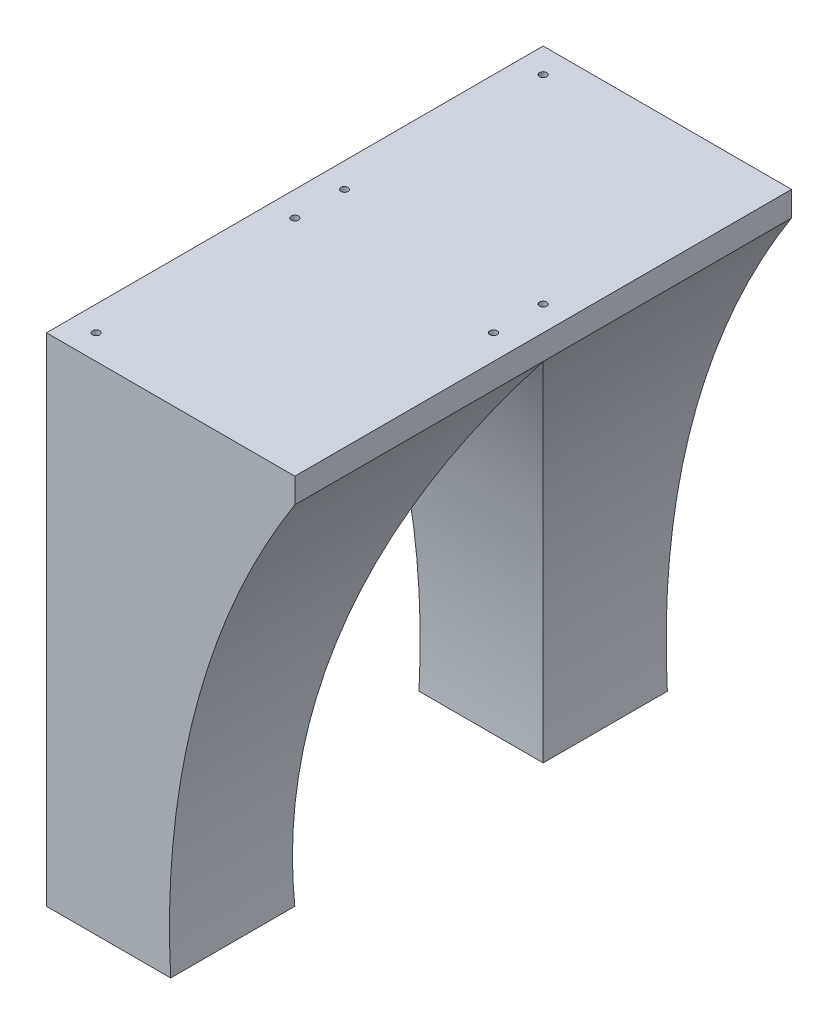
ISO-10303-21;
HEADER;
FILE_DESCRIPTION(('STEP AP214'),'2;1');
FILE_NAME('part.step','',(''),(''),'','','');
FILE_SCHEMA(('AUTOMOTIVE_DESIGN { 1 0 10303 214 1 1 1 1 }'));
ENDSEC;
DATA;
#1=APPLICATION_CONTEXT('core data for automotive mechanical design processes');
#2=APPLICATION_PROTOCOL_DEFINITION('international standard','automotive_design',2000,#1);
#3=PRODUCT_CONTEXT('',#1,'mechanical');
#4=PRODUCT('Part','Part','',(#3));
#5=PRODUCT_RELATED_PRODUCT_CATEGORY('part','',(#4));
#6=PRODUCT_DEFINITION_FORMATION('','',#4);
#7=PRODUCT_DEFINITION_CONTEXT('part definition',#1,'design');
#8=PRODUCT_DEFINITION('design','',#6,#7);
#9=PRODUCT_DEFINITION_SHAPE('','',#8);
#10=(LENGTH_UNIT() NAMED_UNIT(*) SI_UNIT(.MILLI.,.METRE.));
#11=(NAMED_UNIT(*) PLANE_ANGLE_UNIT() SI_UNIT($,.RADIAN.));
#12=(NAMED_UNIT(*) SI_UNIT($,.STERADIAN.) SOLID_ANGLE_UNIT());
#13=UNCERTAINTY_MEASURE_WITH_UNIT(LENGTH_MEASURE(1.E-05),#10,'distance_accuracy_value','');
#14=(GEOMETRIC_REPRESENTATION_CONTEXT(3) GLOBAL_UNCERTAINTY_ASSIGNED_CONTEXT((#13)) GLOBAL_UNIT_ASSIGNED_CONTEXT((#10,
#11,#12)) REPRESENTATION_CONTEXT('',''));
#15=CARTESIAN_POINT('',(0.,0.,0.));
#16=DIRECTION('',(0.,0.,1.));
#17=DIRECTION('',(1.,0.,0.));
#18=AXIS2_PLACEMENT_3D('',#15,#16,#17);
#19=CARTESIAN_POINT('',(0.,-200.,0.));
#20=DIRECTION('',(0.,-1.,0.));
#21=DIRECTION('',(0.,0.,-1.));
#22=AXIS2_PLACEMENT_3D('',#19,#20,#21);
#23=PLANE('',#22);
#24=DIRECTION('',(0.,0.,1.));
#25=VECTOR('',#24,1.);
#26=CARTESIAN_POINT('',(0.,-200.,0.));
#27=LINE('',#26,#25);
#28=CARTESIAN_POINT('',(0.,-200.,-50.));
#29=VERTEX_POINT('',#28);
#30=CARTESIAN_POINT('',(0.,-200.,0.));
#31=VERTEX_POINT('',#30);
#32=EDGE_CURVE('E65',#29,#31,#27,.T.);
#33=ORIENTED_EDGE('',*,*,#32,.F.);
#34=DIRECTION('',(-1.,0.,0.));
#35=VECTOR('',#34,1.);
#36=CARTESIAN_POINT('',(200.,-200.,-50.));
#37=LINE('',#36,#35);
#38=CARTESIAN_POINT('',(50.,-200.,-50.));
#39=VERTEX_POINT('',#38);
#40=EDGE_CURVE('E135',#39,#29,#37,.T.);
#41=ORIENTED_EDGE('',*,*,#40,.F.);
#42=DIRECTION('',(0.,0.,1.));
#43=VECTOR('',#42,1.);
#44=CARTESIAN_POINT('',(50.,-200.,-200.));
#45=LINE('',#44,#43);
#46=CARTESIAN_POINT('',(50.,-200.,0.));
#47=VERTEX_POINT('',#46);
#48=EDGE_CURVE('E50',#39,#47,#45,.T.);
#49=ORIENTED_EDGE('',*,*,#48,.T.);
#50=DIRECTION('',(1.,0.,0.));
#51=VECTOR('',#50,1.);
#52=CARTESIAN_POINT('',(0.,-200.,0.));
#53=LINE('',#52,#51);
#54=EDGE_CURVE('E155',#31,#47,#53,.T.);
#55=ORIENTED_EDGE('',*,*,#54,.F.);
#56=EDGE_LOOP('',(#33,#41,#49,#55));
#57=FACE_BOUND('',#56,.T.);
#58=ADVANCED_FACE('F41',(#57),#23,.T.);
#59=CARTESIAN_POINT('',(0.,-200.,0.));
#60=DIRECTION('',(-1.,0.,0.));
#61=DIRECTION('',(0.,0.,1.));
#62=AXIS2_PLACEMENT_3D('',#59,#60,#61);
#63=PLANE('',#62);
#64=DIRECTION('',(0.,0.,1.));
#65=VECTOR('',#64,1.);
#66=CARTESIAN_POINT('',(0.,0.,0.));
#67=LINE('',#66,#65);
#68=CARTESIAN_POINT('',(0.,0.,-200.));
#69=VERTEX_POINT('',#68);
#70=CARTESIAN_POINT('',(0.,0.,0.));
#71=VERTEX_POINT('',#70);
#72=EDGE_CURVE('E152',#69,#71,#67,.T.);
#73=ORIENTED_EDGE('',*,*,#72,.F.);
#74=DIRECTION('',(0.,1.,0.));
#75=VECTOR('',#74,1.);
#76=CARTESIAN_POINT('',(0.,-200.,-200.));
#77=LINE('',#76,#75);
#78=CARTESIAN_POINT('',(0.,-200.,-200.));
#79=VERTEX_POINT('',#78);
#80=EDGE_CURVE('E190',#79,#69,#77,.T.);
#81=ORIENTED_EDGE('',*,*,#80,.F.);
#82=DIRECTION('',(0.,0.,-1.));
#83=VECTOR('',#82,1.);
#84=CARTESIAN_POINT('',(0.,-200.,-200.));
#85=LINE('',#84,#83);
#86=CARTESIAN_POINT('',(0.,-200.,-150.));
#87=VERTEX_POINT('',#86);
#88=EDGE_CURVE('E120',#87,#79,#85,.T.);
#89=ORIENTED_EDGE('',*,*,#88,.F.);
#90=CARTESIAN_POINT('',(0.,-182.505640777505,169.521434954518));
#91=DIRECTION('',(1.,0.,0.));
#92=DIRECTION('',(0.,0.,-1.));
#93=AXIS2_PLACEMENT_3D('',#90,#91,#92);
#94=CIRCLE('',#93,320.);
#95=CARTESIAN_POINT('',(0.,-10.,-100.));
#96=VERTEX_POINT('',#95);
#97=EDGE_CURVE('E115',#96,#87,#94,.F.);
#98=ORIENTED_EDGE('',*,*,#97,.F.);
#99=CARTESIAN_POINT('',(0.,-182.505640777505,-369.521434954518));
#100=DIRECTION('',(-1.,0.,0.));
#101=DIRECTION('',(0.,0.,1.));
#102=AXIS2_PLACEMENT_3D('',#99,#100,#101);
#103=CIRCLE('',#102,320.);
#104=EDGE_CURVE('E118',#96,#29,#103,.F.);
#105=ORIENTED_EDGE('',*,*,#104,.T.);
#106=ORIENTED_EDGE('',*,*,#32,.T.);
#107=DIRECTION('',(0.,1.,0.));
#108=VECTOR('',#107,1.);
#109=CARTESIAN_POINT('',(0.,-200.,0.));
#110=LINE('',#109,#108);
#111=EDGE_CURVE('E74',#31,#71,#110,.T.);
#112=ORIENTED_EDGE('',*,*,#111,.T.);
#113=EDGE_LOOP('',(#73,#81,#89,#98,#105,#106,#112));
#114=FACE_BOUND('',#113,.T.);
#115=ADVANCED_FACE('F43',(#114),#63,.T.);
#116=CARTESIAN_POINT('',(369.521434954518,-182.505640777505,-200.));
#117=DIRECTION('',(0.,0.,1.));
#118=DIRECTION('',(1.,0.,0.));
#119=AXIS2_PLACEMENT_3D('',#116,#117,#118);
#120=CYLINDRICAL_SURFACE('',#119,320.);
#121=ORIENTED_EDGE('',*,*,#48,.F.);
#122=CARTESIAN_POINT('',(369.521434954518,-182.505640777505,-369.521434954518));
#123=DIRECTION('',(0.707106781186547,0.,0.707106781186547));
#124=DIRECTION('',(-0.707106781186547,0.,0.707106781186547));
#125=AXIS2_PLACEMENT_3D('',#122,#123,#124);
#126=ELLIPSE('',#125,452.54833995939,320.);
#127=CARTESIAN_POINT('',(100.,-10.,-100.));
#128=VERTEX_POINT('',#127);
#129=EDGE_CURVE('E11',#39,#128,#126,.F.);
#130=ORIENTED_EDGE('',*,*,#129,.T.);
#131=DIRECTION('',(0.,0.,1.));
#132=VECTOR('',#131,1.);
#133=CARTESIAN_POINT('',(100.,-10.,-200.));
#134=LINE('',#133,#132);
#135=CARTESIAN_POINT('',(100.,-10.,0.));
#136=VERTEX_POINT('',#135);
#137=EDGE_CURVE('E80',#128,#136,#134,.T.);
#138=ORIENTED_EDGE('',*,*,#137,.T.);
#139=CARTESIAN_POINT('',(369.521434954518,-182.505640777505,0.));
#140=DIRECTION('',(0.,0.,1.));
#141=DIRECTION('',(1.,0.,0.));
#142=AXIS2_PLACEMENT_3D('',#139,#140,#141);
#143=CIRCLE('',#142,320.);
#144=EDGE_CURVE('E141',#47,#136,#143,.F.);
#145=ORIENTED_EDGE('',*,*,#144,.F.);
#146=EDGE_LOOP('',(#121,#130,#138,#145));
#147=FACE_BOUND('',#146,.T.);
#148=ADVANCED_FACE('F268',(#147),#120,.F.);
#149=CARTESIAN_POINT('',(100.,-200.,0.));
#150=DIRECTION('',(1.,0.,0.));
#151=DIRECTION('',(0.,0.,-1.));
#152=AXIS2_PLACEMENT_3D('',#149,#150,#151);
#153=PLANE('',#152);
#154=DIRECTION('',(0.,1.,0.));
#155=VECTOR('',#154,1.);
#156=CARTESIAN_POINT('',(100.,-200.,0.));
#157=LINE('',#156,#155);
#158=CARTESIAN_POINT('',(100.,0.,0.));
#159=VERTEX_POINT('',#158);
#160=EDGE_CURVE('E169',#136,#159,#157,.T.);
#161=ORIENTED_EDGE('',*,*,#160,.F.);
#162=ORIENTED_EDGE('',*,*,#137,.F.);
#163=DIRECTION('',(0.,0.,-1.));
#164=VECTOR('',#163,1.);
#165=CARTESIAN_POINT('',(100.,-10.,0.));
#166=LINE('',#165,#164);
#167=CARTESIAN_POINT('',(100.,-10.,-200.));
#168=VERTEX_POINT('',#167);
#169=EDGE_CURVE('E209',#128,#168,#166,.T.);
#170=ORIENTED_EDGE('',*,*,#169,.T.);
#171=DIRECTION('',(0.,1.,0.));
#172=VECTOR('',#171,1.);
#173=CARTESIAN_POINT('',(100.,-200.,-200.));
#174=LINE('',#173,#172);
#175=CARTESIAN_POINT('',(100.,0.,-200.));
#176=VERTEX_POINT('',#175);
#177=EDGE_CURVE('E182',#168,#176,#174,.T.);
#178=ORIENTED_EDGE('',*,*,#177,.T.);
#179=DIRECTION('',(0.,0.,-1.));
#180=VECTOR('',#179,1.);
#181=CARTESIAN_POINT('',(100.,0.,0.));
#182=LINE('',#181,#180);
#183=EDGE_CURVE('E156',#159,#176,#182,.T.);
#184=ORIENTED_EDGE('',*,*,#183,.F.);
#185=EDGE_LOOP('',(#161,#162,#170,#178,#184));
#186=FACE_BOUND('',#185,.T.);
#187=ADVANCED_FACE('F180',(#186),#153,.T.);
#188=CARTESIAN_POINT('',(0.,-200.,0.));
#189=DIRECTION('',(0.,0.,1.));
#190=DIRECTION('',(1.,0.,0.));
#191=AXIS2_PLACEMENT_3D('',#188,#189,#190);
#192=PLANE('',#191);
#193=ORIENTED_EDGE('',*,*,#54,.T.);
#194=ORIENTED_EDGE('',*,*,#144,.T.);
#195=ORIENTED_EDGE('',*,*,#160,.T.);
#196=DIRECTION('',(1.,0.,0.));
#197=VECTOR('',#196,1.);
#198=CARTESIAN_POINT('',(0.,0.,0.));
#199=LINE('',#198,#197);
#200=EDGE_CURVE('E163',#71,#159,#199,.T.);
#201=ORIENTED_EDGE('',*,*,#200,.F.);
#202=ORIENTED_EDGE('',*,*,#111,.F.);
#203=EDGE_LOOP('',(#193,#194,#195,#201,#202));
#204=FACE_BOUND('',#203,.T.);
#205=ADVANCED_FACE('F177',(#204),#192,.T.);
#206=CARTESIAN_POINT('',(0.,0.,0.));
#207=DIRECTION('',(0.,-1.,0.));
#208=DIRECTION('',(0.,0.,-1.));
#209=AXIS2_PLACEMENT_3D('',#206,#207,#208);
#210=PLANE('',#209);
#211=CARTESIAN_POINT('',(9.99999999999999,0.,-10.));
#212=DIRECTION('',(0.,1.,0.));
#213=DIRECTION('',(0.,0.,1.));
#214=AXIS2_PLACEMENT_3D('',#211,#212,#213);
#215=CIRCLE('',#214,1.45);
#216=CARTESIAN_POINT('',(9.99999999999999,0.,-8.55000000000001));
#217=VERTEX_POINT('',#216);
#218=EDGE_CURVE('E221',#217,#217,#215,.T.);
#219=ORIENTED_EDGE('',*,*,#218,.F.);
#220=EDGE_LOOP('',(#219));
#221=FACE_BOUND('',#220,.T.);
#222=CARTESIAN_POINT('',(90.,0.,-90.));
#223=DIRECTION('',(0.,1.,0.));
#224=DIRECTION('',(0.,0.,1.));
#225=AXIS2_PLACEMENT_3D('',#222,#223,#224);
#226=CIRCLE('',#225,1.45);
#227=CARTESIAN_POINT('',(90.,0.,-88.55));
#228=VERTEX_POINT('',#227);
#229=EDGE_CURVE('E226',#228,#228,#226,.T.);
#230=ORIENTED_EDGE('',*,*,#229,.F.);
#231=EDGE_LOOP('',(#230));
#232=FACE_BOUND('',#231,.T.);
#233=CARTESIAN_POINT('',(9.99999999999999,0.,-90.));
#234=DIRECTION('',(0.,1.,0.));
#235=DIRECTION('',(0.,0.,1.));
#236=AXIS2_PLACEMENT_3D('',#233,#234,#235);
#237=CIRCLE('',#236,1.45);
#238=CARTESIAN_POINT('',(9.99999999999999,0.,-88.55));
#239=VERTEX_POINT('',#238);
#240=EDGE_CURVE('E144',#239,#239,#237,.T.);
#241=ORIENTED_EDGE('',*,*,#240,.F.);
#242=EDGE_LOOP('',(#241));
#243=FACE_BOUND('',#242,.T.);
#244=ORIENTED_EDGE('',*,*,#72,.T.);
#245=ORIENTED_EDGE('',*,*,#200,.T.);
#246=ORIENTED_EDGE('',*,*,#183,.T.);
#247=DIRECTION('',(1.,0.,0.));
#248=VECTOR('',#247,1.);
#249=CARTESIAN_POINT('',(0.,0.,-200.));
#250=LINE('',#249,#248);
#251=EDGE_CURVE('E188',#69,#176,#250,.T.);
#252=ORIENTED_EDGE('',*,*,#251,.F.);
#253=EDGE_LOOP('',(#244,#245,#246,#252));
#254=FACE_BOUND('',#253,.T.);
#255=CARTESIAN_POINT('',(9.99999999999999,0.,-190.));
#256=DIRECTION('',(0.,-1.,0.));
#257=DIRECTION('',(0.,0.,-1.));
#258=AXIS2_PLACEMENT_3D('',#255,#256,#257);
#259=CIRCLE('',#258,1.45);
#260=CARTESIAN_POINT('',(9.99999999999999,0.,-191.45));
#261=VERTEX_POINT('',#260);
#262=EDGE_CURVE('E480',#261,#261,#259,.T.);
#263=ORIENTED_EDGE('',*,*,#262,.T.);
#264=EDGE_LOOP('',(#263));
#265=FACE_BOUND('',#264,.T.);
#266=CARTESIAN_POINT('',(90.,0.,-110.));
#267=DIRECTION('',(0.,-1.,0.));
#268=DIRECTION('',(0.,0.,-1.));
#269=AXIS2_PLACEMENT_3D('',#266,#267,#268);
#270=CIRCLE('',#269,1.45);
#271=CARTESIAN_POINT('',(90.,0.,-111.45));
#272=VERTEX_POINT('',#271);
#273=EDGE_CURVE('E488',#272,#272,#270,.T.);
#274=ORIENTED_EDGE('',*,*,#273,.T.);
#275=EDGE_LOOP('',(#274));
#276=FACE_BOUND('',#275,.T.);
#277=CARTESIAN_POINT('',(9.99999999999999,0.,-110.));
#278=DIRECTION('',(0.,-1.,0.));
#279=DIRECTION('',(0.,0.,-1.));
#280=AXIS2_PLACEMENT_3D('',#277,#278,#279);
#281=CIRCLE('',#280,1.45);
#282=CARTESIAN_POINT('',(9.99999999999999,0.,-111.45));
#283=VERTEX_POINT('',#282);
#284=EDGE_CURVE('E472',#283,#283,#281,.T.);
#285=ORIENTED_EDGE('',*,*,#284,.T.);
#286=EDGE_LOOP('',(#285));
#287=FACE_BOUND('',#286,.T.);
#288=ADVANCED_FACE('F186',(#221,#232,#243,#254,#265,#276,#287),#210,.F.);
#289=CARTESIAN_POINT('',(200.,-182.505640777505,-369.521434954518));
#290=DIRECTION('',(-1.,0.,0.));
#291=DIRECTION('',(0.,0.,1.));
#292=AXIS2_PLACEMENT_3D('',#289,#290,#291);
#293=CYLINDRICAL_SURFACE('',#292,320.);
#294=ORIENTED_EDGE('',*,*,#40,.T.);
#295=ORIENTED_EDGE('',*,*,#104,.F.);
#296=DIRECTION('',(-1.,0.,0.));
#297=VECTOR('',#296,1.);
#298=CARTESIAN_POINT('',(200.,-10.,-100.));
#299=LINE('',#298,#297);
#300=EDGE_CURVE('E125',#128,#96,#299,.T.);
#301=ORIENTED_EDGE('',*,*,#300,.F.);
#302=ORIENTED_EDGE('',*,*,#129,.F.);
#303=EDGE_LOOP('',(#294,#295,#301,#302));
#304=FACE_BOUND('',#303,.T.);
#305=ADVANCED_FACE('F134',(#304),#293,.F.);
#306=CARTESIAN_POINT('',(9.99999999999999,-10.,-90.));
#307=DIRECTION('',(0.,1.,0.));
#308=DIRECTION('',(0.,0.,1.));
#309=AXIS2_PLACEMENT_3D('',#306,#307,#308);
#310=CYLINDRICAL_SURFACE('',#309,1.45);
#311=CARTESIAN_POINT('',(9.99999999999999,-10.,-90.));
#312=DIRECTION('',(0.,1.,0.));
#313=DIRECTION('',(0.,0.,1.));
#314=AXIS2_PLACEMENT_3D('',#311,#312,#313);
#315=CIRCLE('',#314,1.45);
#316=CARTESIAN_POINT('',(9.99999999999999,-10.,-88.55));
#317=VERTEX_POINT('',#316);
#318=EDGE_CURVE('E137',#317,#317,#315,.T.);
#319=ORIENTED_EDGE('',*,*,#318,.F.);
#320=EDGE_LOOP('',(#319));
#321=FACE_BOUND('',#320,.T.);
#322=ORIENTED_EDGE('',*,*,#240,.T.);
#323=EDGE_LOOP('',(#322));
#324=FACE_BOUND('',#323,.T.);
#325=ADVANCED_FACE('F249',(#321,#324),#310,.F.);
#326=CARTESIAN_POINT('',(9.99999999999999,-10.,-90.));
#327=DIRECTION('',(0.,1.,0.));
#328=DIRECTION('',(0.,0.,1.));
#329=AXIS2_PLACEMENT_3D('',#326,#327,#328);
#330=PLANE('',#329);
#331=ORIENTED_EDGE('',*,*,#318,.T.);
#332=EDGE_LOOP('',(#331));
#333=FACE_BOUND('',#332,.T.);
#334=ADVANCED_FACE('F251',(#333),#330,.T.);
#335=CARTESIAN_POINT('',(90.,-10.,-90.));
#336=DIRECTION('',(0.,1.,0.));
#337=DIRECTION('',(0.,0.,1.));
#338=AXIS2_PLACEMENT_3D('',#335,#336,#337);
#339=CYLINDRICAL_SURFACE('',#338,1.45);
#340=CARTESIAN_POINT('',(90.,-10.,-90.));
#341=DIRECTION('',(0.,1.,0.));
#342=DIRECTION('',(0.,0.,1.));
#343=AXIS2_PLACEMENT_3D('',#340,#341,#342);
#344=CIRCLE('',#343,1.45);
#345=CARTESIAN_POINT('',(90.,-10.,-88.55));
#346=VERTEX_POINT('',#345);
#347=EDGE_CURVE('E222',#346,#346,#344,.T.);
#348=ORIENTED_EDGE('',*,*,#347,.F.);
#349=EDGE_LOOP('',(#348));
#350=FACE_BOUND('',#349,.T.);
#351=ORIENTED_EDGE('',*,*,#229,.T.);
#352=EDGE_LOOP('',(#351));
#353=FACE_BOUND('',#352,.T.);
#354=ADVANCED_FACE('F258',(#350,#353),#339,.F.);
#355=CARTESIAN_POINT('',(90.,-10.,-90.));
#356=DIRECTION('',(0.,1.,0.));
#357=DIRECTION('',(0.,0.,1.));
#358=AXIS2_PLACEMENT_3D('',#355,#356,#357);
#359=PLANE('',#358);
#360=ORIENTED_EDGE('',*,*,#347,.T.);
#361=EDGE_LOOP('',(#360));
#362=FACE_BOUND('',#361,.T.);
#363=ADVANCED_FACE('F392',(#362),#359,.T.);
#364=CARTESIAN_POINT('',(9.99999999999999,-10.,-10.));
#365=DIRECTION('',(0.,1.,0.));
#366=DIRECTION('',(0.,0.,1.));
#367=AXIS2_PLACEMENT_3D('',#364,#365,#366);
#368=CYLINDRICAL_SURFACE('',#367,1.45);
#369=CARTESIAN_POINT('',(9.99999999999999,-10.,-10.));
#370=DIRECTION('',(0.,1.,0.));
#371=DIRECTION('',(0.,0.,1.));
#372=AXIS2_PLACEMENT_3D('',#369,#370,#371);
#373=CIRCLE('',#372,1.45);
#374=CARTESIAN_POINT('',(9.99999999999999,-10.,-8.55000000000001));
#375=VERTEX_POINT('',#374);
#376=EDGE_CURVE('E230',#375,#375,#373,.T.);
#377=ORIENTED_EDGE('',*,*,#376,.F.);
#378=EDGE_LOOP('',(#377));
#379=FACE_BOUND('',#378,.T.);
#380=ORIENTED_EDGE('',*,*,#218,.T.);
#381=EDGE_LOOP('',(#380));
#382=FACE_BOUND('',#381,.T.);
#383=ADVANCED_FACE('F238',(#379,#382),#368,.F.);
#384=CARTESIAN_POINT('',(9.99999999999999,-10.,-10.));
#385=DIRECTION('',(0.,1.,0.));
#386=DIRECTION('',(0.,0.,1.));
#387=AXIS2_PLACEMENT_3D('',#384,#385,#386);
#388=PLANE('',#387);
#389=ORIENTED_EDGE('',*,*,#376,.T.);
#390=EDGE_LOOP('',(#389));
#391=FACE_BOUND('',#390,.T.);
#392=ADVANCED_FACE('F300',(#391),#388,.T.);
#393=CARTESIAN_POINT('',(0.,-200.,-200.));
#394=DIRECTION('',(0.,-1.,0.));
#395=DIRECTION('',(0.,0.,1.));
#396=AXIS2_PLACEMENT_3D('',#393,#394,#395);
#397=PLANE('',#396);
#398=ORIENTED_EDGE('',*,*,#88,.T.);
#399=DIRECTION('',(1.,0.,0.));
#400=VECTOR('',#399,1.);
#401=CARTESIAN_POINT('',(0.,-200.,-200.));
#402=LINE('',#401,#400);
#403=CARTESIAN_POINT('',(50.,-200.,-200.));
#404=VERTEX_POINT('',#403);
#405=EDGE_CURVE('E194',#79,#404,#402,.T.);
#406=ORIENTED_EDGE('',*,*,#405,.T.);
#407=DIRECTION('',(0.,0.,-1.));
#408=VECTOR('',#407,1.);
#409=CARTESIAN_POINT('',(50.,-200.,0.));
#410=LINE('',#409,#408);
#411=CARTESIAN_POINT('',(50.,-200.,-150.));
#412=VERTEX_POINT('',#411);
#413=EDGE_CURVE('E215',#412,#404,#410,.T.);
#414=ORIENTED_EDGE('',*,*,#413,.F.);
#415=DIRECTION('',(-1.,0.,0.));
#416=VECTOR('',#415,1.);
#417=CARTESIAN_POINT('',(200.,-200.,-150.));
#418=LINE('',#417,#416);
#419=EDGE_CURVE('E132',#412,#87,#418,.T.);
#420=ORIENTED_EDGE('',*,*,#419,.T.);
#421=EDGE_LOOP('',(#398,#406,#414,#420));
#422=FACE_BOUND('',#421,.T.);
#423=ADVANCED_FACE('F205',(#422),#397,.T.);
#424=CARTESIAN_POINT('',(369.521434954518,-182.505640777505,0.));
#425=DIRECTION('',(0.,0.,-1.));
#426=DIRECTION('',(1.,0.,0.));
#427=AXIS2_PLACEMENT_3D('',#424,#425,#426);
#428=CYLINDRICAL_SURFACE('',#427,320.);
#429=ORIENTED_EDGE('',*,*,#413,.T.);
#430=CARTESIAN_POINT('',(369.521434954518,-182.505640777505,-200.));
#431=DIRECTION('',(0.,0.,1.));
#432=DIRECTION('',(1.,0.,0.));
#433=AXIS2_PLACEMENT_3D('',#430,#431,#432);
#434=CIRCLE('',#433,320.);
#435=EDGE_CURVE('E199',#404,#168,#434,.F.);
#436=ORIENTED_EDGE('',*,*,#435,.T.);
#437=ORIENTED_EDGE('',*,*,#169,.F.);
#438=CARTESIAN_POINT('',(369.521434954518,-182.505640777505,169.521434954518));
#439=DIRECTION('',(-0.707106781186547,0.,0.707106781186547));
#440=DIRECTION('',(-0.707106781186547,0.,-0.707106781186547));
#441=AXIS2_PLACEMENT_3D('',#438,#439,#440);
#442=ELLIPSE('',#441,452.54833995939,320.);
#443=EDGE_CURVE('E129',#412,#128,#442,.F.);
#444=ORIENTED_EDGE('',*,*,#443,.F.);
#445=EDGE_LOOP('',(#429,#436,#437,#444));
#446=FACE_BOUND('',#445,.T.);
#447=ADVANCED_FACE('F299',(#446),#428,.F.);
#448=CARTESIAN_POINT('',(0.,-200.,-200.));
#449=DIRECTION('',(0.,0.,-1.));
#450=DIRECTION('',(1.,0.,0.));
#451=AXIS2_PLACEMENT_3D('',#448,#449,#450);
#452=PLANE('',#451);
#453=ORIENTED_EDGE('',*,*,#405,.F.);
#454=ORIENTED_EDGE('',*,*,#80,.T.);
#455=ORIENTED_EDGE('',*,*,#251,.T.);
#456=ORIENTED_EDGE('',*,*,#177,.F.);
#457=ORIENTED_EDGE('',*,*,#435,.F.);
#458=EDGE_LOOP('',(#453,#454,#455,#456,#457));
#459=FACE_BOUND('',#458,.T.);
#460=ADVANCED_FACE('F197',(#459),#452,.T.);
#461=CARTESIAN_POINT('',(200.,-182.505640777505,169.521434954518));
#462=DIRECTION('',(-1.,0.,0.));
#463=DIRECTION('',(0.,0.,-1.));
#464=AXIS2_PLACEMENT_3D('',#461,#462,#463);
#465=CYLINDRICAL_SURFACE('',#464,320.);
#466=ORIENTED_EDGE('',*,*,#419,.F.);
#467=ORIENTED_EDGE('',*,*,#443,.T.);
#468=ORIENTED_EDGE('',*,*,#300,.T.);
#469=ORIENTED_EDGE('',*,*,#97,.T.);
#470=EDGE_LOOP('',(#466,#467,#468,#469));
#471=FACE_BOUND('',#470,.T.);
#472=ADVANCED_FACE('F128',(#471),#465,.F.);
#473=CARTESIAN_POINT('',(9.99999999999999,-10.,-110.));
#474=DIRECTION('',(0.,1.,0.));
#475=DIRECTION('',(0.,0.,-1.));
#476=AXIS2_PLACEMENT_3D('',#473,#474,#475);
#477=CYLINDRICAL_SURFACE('',#476,1.45);
#478=CARTESIAN_POINT('',(9.99999999999999,-10.,-110.));
#479=DIRECTION('',(0.,-1.,0.));
#480=DIRECTION('',(0.,0.,-1.));
#481=AXIS2_PLACEMENT_3D('',#478,#479,#480);
#482=CIRCLE('',#481,1.45);
#483=CARTESIAN_POINT('',(9.99999999999999,-10.,-111.45));
#484=VERTEX_POINT('',#483);
#485=EDGE_CURVE('E126',#484,#484,#482,.T.);
#486=ORIENTED_EDGE('',*,*,#485,.T.);
#487=EDGE_LOOP('',(#486));
#488=FACE_BOUND('',#487,.T.);
#489=ORIENTED_EDGE('',*,*,#284,.F.);
#490=EDGE_LOOP('',(#489));
#491=FACE_BOUND('',#490,.T.);
#492=ADVANCED_FACE('F327',(#488,#491),#477,.F.);
#493=CARTESIAN_POINT('',(9.99999999999999,-10.,-110.));
#494=DIRECTION('',(0.,1.,0.));
#495=DIRECTION('',(0.,0.,-1.));
#496=AXIS2_PLACEMENT_3D('',#493,#494,#495);
#497=PLANE('',#496);
#498=ORIENTED_EDGE('',*,*,#485,.F.);
#499=EDGE_LOOP('',(#498));
#500=FACE_BOUND('',#499,.T.);
#501=ADVANCED_FACE('F336',(#500),#497,.T.);
#502=CARTESIAN_POINT('',(90.,-10.,-110.));
#503=DIRECTION('',(0.,1.,0.));
#504=DIRECTION('',(0.,0.,-1.));
#505=AXIS2_PLACEMENT_3D('',#502,#503,#504);
#506=CYLINDRICAL_SURFACE('',#505,1.45);
#507=CARTESIAN_POINT('',(90.,-10.,-110.));
#508=DIRECTION('',(0.,-1.,0.));
#509=DIRECTION('',(0.,0.,-1.));
#510=AXIS2_PLACEMENT_3D('',#507,#508,#509);
#511=CIRCLE('',#510,1.45);
#512=CARTESIAN_POINT('',(90.,-10.,-111.45));
#513=VERTEX_POINT('',#512);
#514=EDGE_CURVE('E476',#513,#513,#511,.T.);
#515=ORIENTED_EDGE('',*,*,#514,.T.);
#516=EDGE_LOOP('',(#515));
#517=FACE_BOUND('',#516,.T.);
#518=ORIENTED_EDGE('',*,*,#273,.F.);
#519=EDGE_LOOP('',(#518));
#520=FACE_BOUND('',#519,.T.);
#521=ADVANCED_FACE('F346',(#517,#520),#506,.F.);
#522=CARTESIAN_POINT('',(90.,-10.,-110.));
#523=DIRECTION('',(0.,1.,0.));
#524=DIRECTION('',(0.,0.,-1.));
#525=AXIS2_PLACEMENT_3D('',#522,#523,#524);
#526=PLANE('',#525);
#527=ORIENTED_EDGE('',*,*,#514,.F.);
#528=EDGE_LOOP('',(#527));
#529=FACE_BOUND('',#528,.T.);
#530=ADVANCED_FACE('F356',(#529),#526,.T.);
#531=CARTESIAN_POINT('',(9.99999999999999,-10.,-190.));
#532=DIRECTION('',(0.,1.,0.));
#533=DIRECTION('',(0.,0.,-1.));
#534=AXIS2_PLACEMENT_3D('',#531,#532,#533);
#535=CYLINDRICAL_SURFACE('',#534,1.45);
#536=CARTESIAN_POINT('',(9.99999999999999,-10.,-190.));
#537=DIRECTION('',(0.,-1.,0.));
#538=DIRECTION('',(0.,0.,-1.));
#539=AXIS2_PLACEMENT_3D('',#536,#537,#538);
#540=CIRCLE('',#539,1.45);
#541=CARTESIAN_POINT('',(9.99999999999999,-10.,-191.45));
#542=VERTEX_POINT('',#541);
#543=EDGE_CURVE('E484',#542,#542,#540,.T.);
#544=ORIENTED_EDGE('',*,*,#543,.T.);
#545=EDGE_LOOP('',(#544));
#546=FACE_BOUND('',#545,.T.);
#547=ORIENTED_EDGE('',*,*,#262,.F.);
#548=EDGE_LOOP('',(#547));
#549=FACE_BOUND('',#548,.T.);
#550=ADVANCED_FACE('F366',(#546,#549),#535,.F.);
#551=CARTESIAN_POINT('',(9.99999999999999,-10.,-190.));
#552=DIRECTION('',(0.,1.,0.));
#553=DIRECTION('',(0.,0.,-1.));
#554=AXIS2_PLACEMENT_3D('',#551,#552,#553);
#555=PLANE('',#554);
#556=ORIENTED_EDGE('',*,*,#543,.F.);
#557=EDGE_LOOP('',(#556));
#558=FACE_BOUND('',#557,.T.);
#559=ADVANCED_FACE('F376',(#558),#555,.T.);
#560=CLOSED_SHELL('',(#58,#115,#148,#187,#205,#288,#305,#325,#334,#354,#363,#383,#392,#423,#447,
#460,#472,#492,#501,#521,#530,#550,#559));
#561=MANIFOLD_SOLID_BREP('B2',#560);
#562=ADVANCED_BREP_SHAPE_REPRESENTATION('',(#18,#561),#14);
#563=SHAPE_DEFINITION_REPRESENTATION(#9,#562);
ENDSEC;
END-ISO-10303-21;
